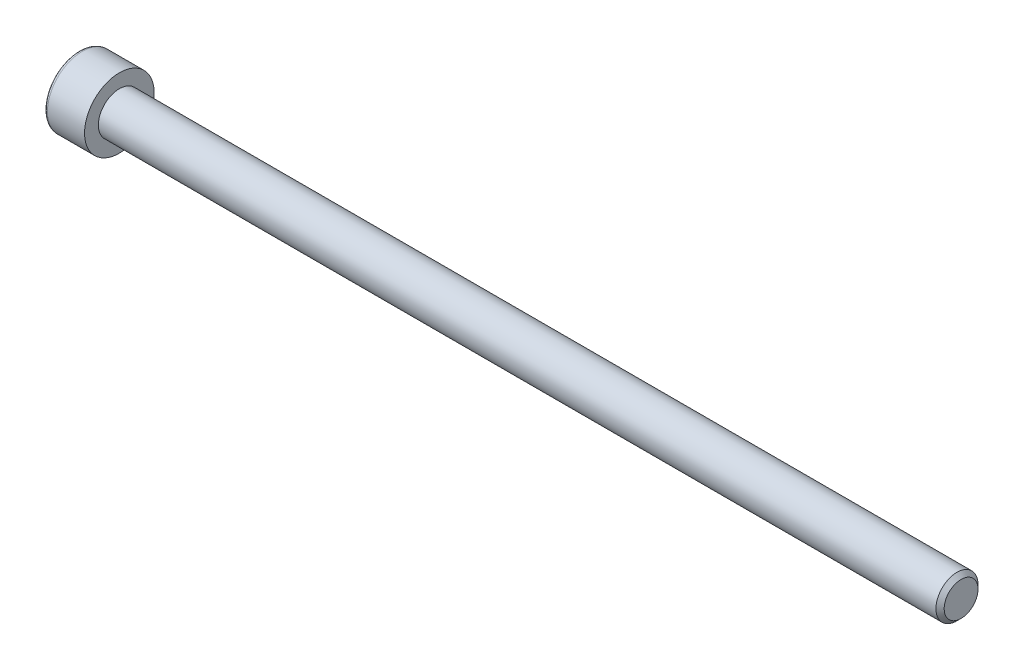
ISO-10303-21;
HEADER;
FILE_DESCRIPTION(('STEP AP214'),'2;1');
FILE_NAME('part.step','',(''),(''),'','','');
FILE_SCHEMA(('AUTOMOTIVE_DESIGN { 1 0 10303 214 1 1 1 1 }'));
ENDSEC;
DATA;
#1=APPLICATION_CONTEXT('core data for automotive mechanical design processes');
#2=APPLICATION_PROTOCOL_DEFINITION('international standard','automotive_design',2000,#1);
#3=PRODUCT_CONTEXT('',#1,'mechanical');
#4=PRODUCT('Part','Part','',(#3));
#5=PRODUCT_RELATED_PRODUCT_CATEGORY('part','',(#4));
#6=PRODUCT_DEFINITION_FORMATION('','',#4);
#7=PRODUCT_DEFINITION_CONTEXT('part definition',#1,'design');
#8=PRODUCT_DEFINITION('design','',#6,#7);
#9=PRODUCT_DEFINITION_SHAPE('','',#8);
#10=(LENGTH_UNIT() NAMED_UNIT(*) SI_UNIT(.MILLI.,.METRE.));
#11=(NAMED_UNIT(*) PLANE_ANGLE_UNIT() SI_UNIT($,.RADIAN.));
#12=(NAMED_UNIT(*) SI_UNIT($,.STERADIAN.) SOLID_ANGLE_UNIT());
#13=UNCERTAINTY_MEASURE_WITH_UNIT(LENGTH_MEASURE(1.E-05),#10,'distance_accuracy_value','');
#14=(GEOMETRIC_REPRESENTATION_CONTEXT(3) GLOBAL_UNCERTAINTY_ASSIGNED_CONTEXT((#13)) GLOBAL_UNIT_ASSIGNED_CONTEXT((#10,
#11,#12)) REPRESENTATION_CONTEXT('',''));
#15=CARTESIAN_POINT('',(0.,0.,0.));
#16=DIRECTION('',(0.,0.,1.));
#17=DIRECTION('',(1.,0.,0.));
#18=AXIS2_PLACEMENT_3D('',#15,#16,#17);
#19=CARTESIAN_POINT('',(0.,0.,0.));
#20=DIRECTION('',(-1.,0.,0.));
#21=DIRECTION('',(0.,0.,1.));
#22=AXIS2_PLACEMENT_3D('',#19,#20,#21);
#23=PLANE('',#22);
#24=CARTESIAN_POINT('',(0.,0.,0.));
#25=DIRECTION('',(-1.,0.,0.));
#26=DIRECTION('',(0.,0.,1.));
#27=AXIS2_PLACEMENT_3D('',#24,#25,#26);
#28=CIRCLE('',#27,4.14);
#29=CARTESIAN_POINT('',(0.,0.,4.14));
#30=VERTEX_POINT('',#29);
#31=EDGE_CURVE('E108',#30,#30,#28,.T.);
#32=ORIENTED_EDGE('',*,*,#31,.F.);
#33=EDGE_LOOP('',(#32));
#34=FACE_BOUND('',#33,.T.);
#35=CARTESIAN_POINT('',(0.,0.,0.));
#36=DIRECTION('',(-1.,0.,0.));
#37=DIRECTION('',(0.,0.,1.));
#38=AXIS2_PLACEMENT_3D('',#35,#36,#37);
#39=CIRCLE('',#38,2.5);
#40=CARTESIAN_POINT('',(0.,0.,2.5));
#41=VERTEX_POINT('',#40);
#42=EDGE_CURVE('E11',#41,#41,#39,.F.);
#43=ORIENTED_EDGE('',*,*,#42,.F.);
#44=EDGE_LOOP('',(#43));
#45=FACE_BOUND('',#44,.T.);
#46=ADVANCED_FACE('F16',(#34,#45),#23,.F.);
#47=CARTESIAN_POINT('',(-4.82,3.726,0.));
#48=DIRECTION('',(1.,0.,0.));
#49=DIRECTION('',(0.,0.,-1.));
#50=AXIS2_PLACEMENT_3D('',#47,#48,#49);
#51=PLANE('',#50);
#52=CARTESIAN_POINT('',(-4.82,0.,0.));
#53=DIRECTION('',(-1.,0.,0.));
#54=DIRECTION('',(0.,0.,1.));
#55=AXIS2_PLACEMENT_3D('',#52,#53,#54);
#56=CIRCLE('',#55,3.726);
#57=CARTESIAN_POINT('',(-4.82,0.,3.726));
#58=VERTEX_POINT('',#57);
#59=EDGE_CURVE('E91',#58,#58,#56,.T.);
#60=ORIENTED_EDGE('',*,*,#59,.T.);
#61=EDGE_LOOP('',(#60));
#62=FACE_BOUND('',#61,.T.);
#63=DIRECTION('',(0.,0.5,0.866025403784438));
#64=VECTOR('',#63,1.);
#65=CARTESIAN_POINT('',(-4.82,-0.800550807568874,2.61340532725041));
#66=LINE('',#65,#64);
#67=CARTESIAN_POINT('',(-4.82,-2.30940107675851,0.));
#68=VERTEX_POINT('',#67);
#69=CARTESIAN_POINT('',(-4.82,-1.15470053837925,2.));
#70=VERTEX_POINT('',#69);
#71=EDGE_CURVE('E25',#68,#70,#66,.T.);
#72=ORIENTED_EDGE('',*,*,#71,.F.);
#73=DIRECTION('',(0.,-0.5,0.866025403784439));
#74=VECTOR('',#73,1.);
#75=CARTESIAN_POINT('',(-4.82,-0.800550807568879,-2.61340532725041));
#76=LINE('',#75,#74);
#77=CARTESIAN_POINT('',(-4.82,-1.15470053837925,-2.));
#78=VERTEX_POINT('',#77);
#79=EDGE_CURVE('E40',#78,#68,#76,.T.);
#80=ORIENTED_EDGE('',*,*,#79,.F.);
#81=DIRECTION('',(0.,-1.,0.));
#82=VECTOR('',#81,1.);
#83=CARTESIAN_POINT('',(-4.82,3.726,-2.));
#84=LINE('',#83,#82);
#85=CARTESIAN_POINT('',(-4.82,1.15470053837925,-2.));
#86=VERTEX_POINT('',#85);
#87=EDGE_CURVE('E121',#86,#78,#84,.T.);
#88=ORIENTED_EDGE('',*,*,#87,.F.);
#89=DIRECTION('',(0.,-0.5,-0.866025403784439));
#90=VECTOR('',#89,1.);
#91=CARTESIAN_POINT('',(-4.82,2.66355080756888,0.613405327250409));
#92=LINE('',#91,#90);
#93=CARTESIAN_POINT('',(-4.82,2.30940107675851,0.));
#94=VERTEX_POINT('',#93);
#95=EDGE_CURVE('E118',#94,#86,#92,.T.);
#96=ORIENTED_EDGE('',*,*,#95,.F.);
#97=DIRECTION('',(0.,0.5,-0.866025403784439));
#98=VECTOR('',#97,1.);
#99=CARTESIAN_POINT('',(-4.82,2.66355080756888,-0.613405327250409));
#100=LINE('',#99,#98);
#101=CARTESIAN_POINT('',(-4.82,1.15470053837925,2.));
#102=VERTEX_POINT('',#101);
#103=EDGE_CURVE('E115',#102,#94,#100,.T.);
#104=ORIENTED_EDGE('',*,*,#103,.F.);
#105=DIRECTION('',(0.,1.,0.));
#106=VECTOR('',#105,1.);
#107=CARTESIAN_POINT('',(-4.82,3.726,2.));
#108=LINE('',#107,#106);
#109=EDGE_CURVE('E112',#70,#102,#108,.T.);
#110=ORIENTED_EDGE('',*,*,#109,.F.);
#111=EDGE_LOOP('',(#72,#80,#88,#96,#104,#110));
#112=FACE_BOUND('',#111,.T.);
#113=ADVANCED_FACE('F18',(#62,#112),#51,.F.);
#114=CARTESIAN_POINT('',(-4.82,0.,0.));
#115=DIRECTION('',(-1.,0.,0.));
#116=DIRECTION('',(0.,0.,1.));
#117=AXIS2_PLACEMENT_3D('',#114,#115,#116);
#118=CYLINDRICAL_SURFACE('',#117,4.14);
#119=CARTESIAN_POINT('',(-4.406,0.,0.));
#120=DIRECTION('',(-1.,0.,0.));
#121=DIRECTION('',(0.,0.,1.));
#122=AXIS2_PLACEMENT_3D('',#119,#120,#121);
#123=CIRCLE('',#122,4.14);
#124=CARTESIAN_POINT('',(-4.406,0.,4.14));
#125=VERTEX_POINT('',#124);
#126=EDGE_CURVE('E98',#125,#125,#123,.T.);
#127=ORIENTED_EDGE('',*,*,#126,.F.);
#128=EDGE_LOOP('',(#127));
#129=FACE_BOUND('',#128,.T.);
#130=ORIENTED_EDGE('',*,*,#31,.T.);
#131=EDGE_LOOP('',(#130));
#132=FACE_BOUND('',#131,.T.);
#133=ADVANCED_FACE('F202',(#129,#132),#118,.T.);
#134=CARTESIAN_POINT('',(-4.406,0.,0.));
#135=DIRECTION('',(-1.,0.,0.));
#136=DIRECTION('',(0.,0.,1.));
#137=AXIS2_PLACEMENT_3D('',#134,#135,#136);
#138=TOROIDAL_SURFACE('',#137,3.726,0.414);
#139=ORIENTED_EDGE('',*,*,#59,.F.);
#140=EDGE_LOOP('',(#139));
#141=FACE_BOUND('',#140,.T.);
#142=ORIENTED_EDGE('',*,*,#126,.T.);
#143=EDGE_LOOP('',(#142));
#144=FACE_BOUND('',#143,.T.);
#145=ADVANCED_FACE('F209',(#141,#144),#138,.T.);
#146=CARTESIAN_POINT('',(-2.32,-1.15470053837925,2.));
#147=DIRECTION('',(0.,0.866025403784438,-0.5));
#148=DIRECTION('',(0.,0.5,0.866025403784438));
#149=AXIS2_PLACEMENT_3D('',#146,#147,#148);
#150=PLANE('',#149);
#151=ORIENTED_EDGE('',*,*,#71,.T.);
#152=DIRECTION('',(-1.,0.,0.));
#153=VECTOR('',#152,1.);
#154=CARTESIAN_POINT('',(-2.32,-1.15470053837925,2.));
#155=LINE('',#154,#153);
#156=CARTESIAN_POINT('',(-2.32,-1.15470053837925,2.));
#157=VERTEX_POINT('',#156);
#158=EDGE_CURVE('E32',#157,#70,#155,.T.);
#159=ORIENTED_EDGE('',*,*,#158,.F.);
#160=DIRECTION('',(0.,-0.5,-0.866025403784439));
#161=VECTOR('',#160,1.);
#162=CARTESIAN_POINT('',(-2.32,-1.15470053837925,2.));
#163=LINE('',#162,#161);
#164=CARTESIAN_POINT('',(-2.32,-2.30940107675851,0.));
#165=VERTEX_POINT('',#164);
#166=EDGE_CURVE('E76',#157,#165,#163,.T.);
#167=ORIENTED_EDGE('',*,*,#166,.T.);
#168=DIRECTION('',(-1.,0.,0.));
#169=VECTOR('',#168,1.);
#170=CARTESIAN_POINT('',(-2.32,-2.30940107675851,0.));
#171=LINE('',#170,#169);
#172=EDGE_CURVE('E84',#165,#68,#171,.T.);
#173=ORIENTED_EDGE('',*,*,#172,.T.);
#174=EDGE_LOOP('',(#151,#159,#167,#173));
#175=FACE_BOUND('',#174,.T.);
#176=ADVANCED_FACE('F83',(#175),#150,.T.);
#177=CARTESIAN_POINT('',(-2.32,-2.30940107675851,0.));
#178=DIRECTION('',(0.,0.866025403784439,0.5));
#179=DIRECTION('',(0.,-0.5,0.866025403784439));
#180=AXIS2_PLACEMENT_3D('',#177,#178,#179);
#181=PLANE('',#180);
#182=ORIENTED_EDGE('',*,*,#79,.T.);
#183=ORIENTED_EDGE('',*,*,#172,.F.);
#184=DIRECTION('',(0.,0.5,-0.866025403784439));
#185=VECTOR('',#184,1.);
#186=CARTESIAN_POINT('',(-2.32,-2.30940107675851,0.));
#187=LINE('',#186,#185);
#188=CARTESIAN_POINT('',(-2.32,-1.15470053837925,-2.));
#189=VERTEX_POINT('',#188);
#190=EDGE_CURVE('E72',#165,#189,#187,.T.);
#191=ORIENTED_EDGE('',*,*,#190,.T.);
#192=DIRECTION('',(-1.,0.,0.));
#193=VECTOR('',#192,1.);
#194=CARTESIAN_POINT('',(-2.32,-1.15470053837925,-2.));
#195=LINE('',#194,#193);
#196=EDGE_CURVE('E92',#189,#78,#195,.T.);
#197=ORIENTED_EDGE('',*,*,#196,.T.);
#198=EDGE_LOOP('',(#182,#183,#191,#197));
#199=FACE_BOUND('',#198,.T.);
#200=ADVANCED_FACE('F89',(#199),#181,.T.);
#201=CARTESIAN_POINT('',(-2.32,-1.15470053837925,-2.));
#202=DIRECTION('',(0.,0.,1.));
#203=DIRECTION('',(0.,-1.,0.));
#204=AXIS2_PLACEMENT_3D('',#201,#202,#203);
#205=PLANE('',#204);
#206=ORIENTED_EDGE('',*,*,#87,.T.);
#207=ORIENTED_EDGE('',*,*,#196,.F.);
#208=DIRECTION('',(0.,1.,0.));
#209=VECTOR('',#208,1.);
#210=CARTESIAN_POINT('',(-2.32,-1.15470053837925,-2.));
#211=LINE('',#210,#209);
#212=CARTESIAN_POINT('',(-2.32,1.15470053837925,-2.));
#213=VERTEX_POINT('',#212);
#214=EDGE_CURVE('E78',#189,#213,#211,.T.);
#215=ORIENTED_EDGE('',*,*,#214,.T.);
#216=DIRECTION('',(-1.,0.,0.));
#217=VECTOR('',#216,1.);
#218=CARTESIAN_POINT('',(-2.32,1.15470053837925,-2.));
#219=LINE('',#218,#217);
#220=EDGE_CURVE('E101',#213,#86,#219,.T.);
#221=ORIENTED_EDGE('',*,*,#220,.T.);
#222=EDGE_LOOP('',(#206,#207,#215,#221));
#223=FACE_BOUND('',#222,.T.);
#224=ADVANCED_FACE('F160',(#223),#205,.T.);
#225=CARTESIAN_POINT('',(-2.32,1.15470053837925,-2.));
#226=DIRECTION('',(0.,-0.866025403784438,0.5));
#227=DIRECTION('',(0.,-0.5,-0.866025403784439));
#228=AXIS2_PLACEMENT_3D('',#225,#226,#227);
#229=PLANE('',#228);
#230=ORIENTED_EDGE('',*,*,#95,.T.);
#231=ORIENTED_EDGE('',*,*,#220,.F.);
#232=DIRECTION('',(0.,0.5,0.866025403784439));
#233=VECTOR('',#232,1.);
#234=CARTESIAN_POINT('',(-2.32,1.15470053837925,-2.));
#235=LINE('',#234,#233);
#236=CARTESIAN_POINT('',(-2.32,2.30940107675851,0.));
#237=VERTEX_POINT('',#236);
#238=EDGE_CURVE('E163',#213,#237,#235,.T.);
#239=ORIENTED_EDGE('',*,*,#238,.T.);
#240=DIRECTION('',(-1.,0.,0.));
#241=VECTOR('',#240,1.);
#242=CARTESIAN_POINT('',(-2.32,2.30940107675851,0.));
#243=LINE('',#242,#241);
#244=EDGE_CURVE('E142',#237,#94,#243,.T.);
#245=ORIENTED_EDGE('',*,*,#244,.T.);
#246=EDGE_LOOP('',(#230,#231,#239,#245));
#247=FACE_BOUND('',#246,.T.);
#248=ADVANCED_FACE('F162',(#247),#229,.T.);
#249=CARTESIAN_POINT('',(-2.32,2.30940107675851,0.));
#250=DIRECTION('',(0.,-0.866025403784439,-0.5));
#251=DIRECTION('',(0.,0.5,-0.866025403784439));
#252=AXIS2_PLACEMENT_3D('',#249,#250,#251);
#253=PLANE('',#252);
#254=ORIENTED_EDGE('',*,*,#103,.T.);
#255=ORIENTED_EDGE('',*,*,#244,.F.);
#256=DIRECTION('',(0.,-0.5,0.866025403784439));
#257=VECTOR('',#256,1.);
#258=CARTESIAN_POINT('',(-2.32,2.30940107675851,0.));
#259=LINE('',#258,#257);
#260=CARTESIAN_POINT('',(-2.32,1.15470053837925,2.));
#261=VERTEX_POINT('',#260);
#262=EDGE_CURVE('E140',#237,#261,#259,.T.);
#263=ORIENTED_EDGE('',*,*,#262,.T.);
#264=DIRECTION('',(-1.,0.,0.));
#265=VECTOR('',#264,1.);
#266=CARTESIAN_POINT('',(-2.32,1.15470053837925,2.));
#267=LINE('',#266,#265);
#268=EDGE_CURVE('E134',#261,#102,#267,.T.);
#269=ORIENTED_EDGE('',*,*,#268,.T.);
#270=EDGE_LOOP('',(#254,#255,#263,#269));
#271=FACE_BOUND('',#270,.T.);
#272=ADVANCED_FACE('F136',(#271),#253,.T.);
#273=CARTESIAN_POINT('',(-2.32,1.15470053837925,2.));
#274=DIRECTION('',(0.,0.,-1.));
#275=DIRECTION('',(0.,1.,0.));
#276=AXIS2_PLACEMENT_3D('',#273,#274,#275);
#277=PLANE('',#276);
#278=ORIENTED_EDGE('',*,*,#109,.T.);
#279=ORIENTED_EDGE('',*,*,#268,.F.);
#280=DIRECTION('',(0.,-1.,0.));
#281=VECTOR('',#280,1.);
#282=CARTESIAN_POINT('',(-2.32,1.15470053837925,2.));
#283=LINE('',#282,#281);
#284=EDGE_CURVE('E150',#261,#157,#283,.T.);
#285=ORIENTED_EDGE('',*,*,#284,.T.);
#286=ORIENTED_EDGE('',*,*,#158,.T.);
#287=EDGE_LOOP('',(#278,#279,#285,#286));
#288=FACE_BOUND('',#287,.T.);
#289=ADVANCED_FACE('F133',(#288),#277,.T.);
#290=CARTESIAN_POINT('',(-2.32,-2.30940107675851,0.));
#291=DIRECTION('',(1.,0.,0.));
#292=DIRECTION('',(0.,0.,1.));
#293=AXIS2_PLACEMENT_3D('',#290,#291,#292);
#294=PLANE('',#293);
#295=ORIENTED_EDGE('',*,*,#166,.F.);
#296=ORIENTED_EDGE('',*,*,#284,.F.);
#297=ORIENTED_EDGE('',*,*,#262,.F.);
#298=ORIENTED_EDGE('',*,*,#238,.F.);
#299=ORIENTED_EDGE('',*,*,#214,.F.);
#300=ORIENTED_EDGE('',*,*,#190,.F.);
#301=EDGE_LOOP('',(#295,#296,#297,#298,#299,#300));
#302=FACE_BOUND('',#301,.T.);
#303=ADVANCED_FACE('F74',(#302),#294,.F.);
#304=CARTESIAN_POINT('',(0.,0.,0.));
#305=DIRECTION('',(-1.,0.,0.));
#306=DIRECTION('',(0.,0.,1.));
#307=AXIS2_PLACEMENT_3D('',#304,#305,#306);
#308=CYLINDRICAL_SURFACE('',#307,2.5);
#309=CARTESIAN_POINT('',(99.5095,0.,0.));
#310=DIRECTION('',(-1.,0.,0.));
#311=DIRECTION('',(0.,0.,1.));
#312=AXIS2_PLACEMENT_3D('',#309,#310,#311);
#313=CIRCLE('',#312,2.5);
#314=CARTESIAN_POINT('',(99.5095,0.,2.5));
#315=VERTEX_POINT('',#314);
#316=EDGE_CURVE('E173',#315,#315,#313,.T.);
#317=ORIENTED_EDGE('',*,*,#316,.T.);
#318=EDGE_LOOP('',(#317));
#319=FACE_BOUND('',#318,.T.);
#320=ORIENTED_EDGE('',*,*,#42,.T.);
#321=EDGE_LOOP('',(#320));
#322=FACE_BOUND('',#321,.T.);
#323=ADVANCED_FACE('F179',(#319,#322),#308,.T.);
#324=CARTESIAN_POINT('',(100.,0.,0.));
#325=DIRECTION('',(-1.,0.,0.));
#326=DIRECTION('',(0.,0.,1.));
#327=AXIS2_PLACEMENT_3D('',#324,#325,#326);
#328=PLANE('',#327);
#329=CARTESIAN_POINT('',(100.,0.,0.));
#330=DIRECTION('',(-1.,0.,0.));
#331=DIRECTION('',(0.,0.,1.));
#332=AXIS2_PLACEMENT_3D('',#329,#330,#331);
#333=CIRCLE('',#332,2.0095);
#334=CARTESIAN_POINT('',(100.,0.,2.0095));
#335=VERTEX_POINT('',#334);
#336=EDGE_CURVE('E87',#335,#335,#333,.T.);
#337=ORIENTED_EDGE('',*,*,#336,.F.);
#338=EDGE_LOOP('',(#337));
#339=FACE_BOUND('',#338,.T.);
#340=ADVANCED_FACE('F185',(#339),#328,.F.);
#341=CARTESIAN_POINT('',(100.,0.,0.));
#342=DIRECTION('',(-1.,0.,0.));
#343=DIRECTION('',(0.,0.,1.));
#344=AXIS2_PLACEMENT_3D('',#341,#342,#343);
#345=CONICAL_SURFACE('',#344,2.0095,0.785398163397455);
#346=ORIENTED_EDGE('',*,*,#316,.F.);
#347=EDGE_LOOP('',(#346));
#348=FACE_BOUND('',#347,.T.);
#349=ORIENTED_EDGE('',*,*,#336,.T.);
#350=EDGE_LOOP('',(#349));
#351=FACE_BOUND('',#350,.T.);
#352=ADVANCED_FACE('F182',(#348,#351),#345,.T.);
#353=CLOSED_SHELL('',(#46,#113,#133,#145,#176,#200,#224,#248,#272,#289,#303,#323,#340,#352));
#354=MANIFOLD_SOLID_BREP('B1',#353);
#355=ADVANCED_BREP_SHAPE_REPRESENTATION('',(#18,#354),#14);
#356=SHAPE_DEFINITION_REPRESENTATION(#9,#355);
ENDSEC;
END-ISO-10303-21;
